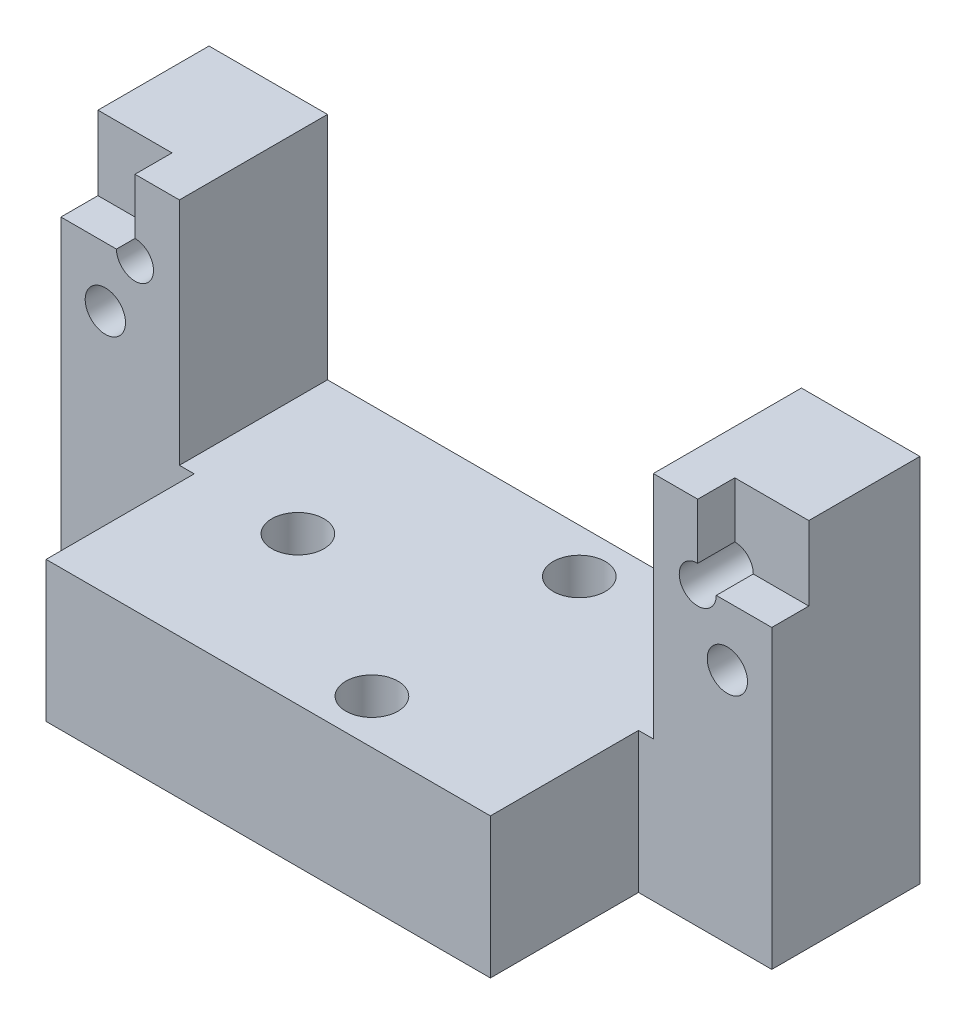
ISO-10303-21;
HEADER;
FILE_DESCRIPTION(('STEP AP214'),'2;1');
FILE_NAME('part.step','',(''),(''),'','','');
FILE_SCHEMA(('AUTOMOTIVE_DESIGN { 1 0 10303 214 1 1 1 1 }'));
ENDSEC;
DATA;
#1=APPLICATION_CONTEXT('core data for automotive mechanical design processes');
#2=APPLICATION_PROTOCOL_DEFINITION('international standard','automotive_design',2000,#1);
#3=PRODUCT_CONTEXT('',#1,'mechanical');
#4=PRODUCT('Part','Part','',(#3));
#5=PRODUCT_RELATED_PRODUCT_CATEGORY('part','',(#4));
#6=PRODUCT_DEFINITION_FORMATION('','',#4);
#7=PRODUCT_DEFINITION_CONTEXT('part definition',#1,'design');
#8=PRODUCT_DEFINITION('design','',#6,#7);
#9=PRODUCT_DEFINITION_SHAPE('','',#8);
#10=(LENGTH_UNIT() NAMED_UNIT(*) SI_UNIT(.MILLI.,.METRE.));
#11=(NAMED_UNIT(*) PLANE_ANGLE_UNIT() SI_UNIT($,.RADIAN.));
#12=(NAMED_UNIT(*) SI_UNIT($,.STERADIAN.) SOLID_ANGLE_UNIT());
#13=UNCERTAINTY_MEASURE_WITH_UNIT(LENGTH_MEASURE(1.E-05),#10,'distance_accuracy_value','');
#14=(GEOMETRIC_REPRESENTATION_CONTEXT(3) GLOBAL_UNCERTAINTY_ASSIGNED_CONTEXT((#13)) GLOBAL_UNIT_ASSIGNED_CONTEXT((#10,
#11,#12)) REPRESENTATION_CONTEXT('',''));
#15=CARTESIAN_POINT('',(0.,0.,0.));
#16=DIRECTION('',(0.,0.,1.));
#17=DIRECTION('',(1.,0.,0.));
#18=AXIS2_PLACEMENT_3D('',#15,#16,#17);
#19=CARTESIAN_POINT('',(0.,0.,0.));
#20=DIRECTION('',(0.,0.,-1.));
#21=DIRECTION('',(1.,0.,0.));
#22=AXIS2_PLACEMENT_3D('',#19,#20,#21);
#23=PLANE('',#22);
#24=CARTESIAN_POINT('',(-26.67,4.445,0.));
#25=DIRECTION('',(0.,0.,1.));
#26=DIRECTION('',(1.,0.,0.));
#27=AXIS2_PLACEMENT_3D('',#24,#25,#26);
#28=CIRCLE('',#27,1.72719999999999);
#29=CARTESIAN_POINT('',(-24.9428,4.445,0.));
#30=VERTEX_POINT('',#29);
#31=EDGE_CURVE('E485',#30,#30,#28,.T.);
#32=ORIENTED_EDGE('',*,*,#31,.F.);
#33=EDGE_LOOP('',(#32));
#34=FACE_BOUND('',#33,.T.);
#35=CARTESIAN_POINT('',(-24.13,9.525,0.));
#36=DIRECTION('',(0.,0.,-1.));
#37=DIRECTION('',(-1.,0.,0.));
#38=AXIS2_PLACEMENT_3D('',#35,#36,#37);
#39=CIRCLE('',#38,1.5875);
#40=CARTESIAN_POINT('',(-24.13,11.1125,0.));
#41=VERTEX_POINT('',#40);
#42=CARTESIAN_POINT('',(-25.7175,9.525,0.));
#43=VERTEX_POINT('',#42);
#44=EDGE_CURVE('E171',#41,#43,#39,.T.);
#45=ORIENTED_EDGE('',*,*,#44,.T.);
#46=DIRECTION('',(-1.,0.,0.));
#47=VECTOR('',#46,1.);
#48=CARTESIAN_POINT('',(-30.48,9.525,0.));
#49=LINE('',#48,#47);
#50=CARTESIAN_POINT('',(-30.48,9.525,0.));
#51=VERTEX_POINT('',#50);
#52=EDGE_CURVE('E56',#43,#51,#49,.T.);
#53=ORIENTED_EDGE('',*,*,#52,.T.);
#54=DIRECTION('',(0.,1.,0.));
#55=VECTOR('',#54,1.);
#56=CARTESIAN_POINT('',(-30.48,15.875,0.));
#57=LINE('',#56,#55);
#58=CARTESIAN_POINT('',(-30.48,-15.875,0.));
#59=VERTEX_POINT('',#58);
#60=EDGE_CURVE('E253',#59,#51,#57,.T.);
#61=ORIENTED_EDGE('',*,*,#60,.F.);
#62=DIRECTION('',(-1.,0.,0.));
#63=VECTOR('',#62,1.);
#64=CARTESIAN_POINT('',(-30.48,-15.875,0.));
#65=LINE('',#64,#63);
#66=CARTESIAN_POINT('',(-19.05,-15.875,0.));
#67=VERTEX_POINT('',#66);
#68=EDGE_CURVE('E255',#67,#59,#65,.T.);
#69=ORIENTED_EDGE('',*,*,#68,.F.);
#70=DIRECTION('',(0.,-1.,0.));
#71=VECTOR('',#70,1.);
#72=CARTESIAN_POINT('',(-19.05,15.875,0.));
#73=LINE('',#72,#71);
#74=CARTESIAN_POINT('',(-19.05,-3.8354,0.));
#75=VERTEX_POINT('',#74);
#76=EDGE_CURVE('E258',#75,#67,#73,.T.);
#77=ORIENTED_EDGE('',*,*,#76,.F.);
#78=DIRECTION('',(1.,0.,0.));
#79=VECTOR('',#78,1.);
#80=CARTESIAN_POINT('',(-20.32,-3.8354,0.));
#81=LINE('',#80,#79);
#82=CARTESIAN_POINT('',(-20.32,-3.8354,0.));
#83=VERTEX_POINT('',#82);
#84=EDGE_CURVE('E337',#83,#75,#81,.T.);
#85=ORIENTED_EDGE('',*,*,#84,.F.);
#86=DIRECTION('',(0.,-1.,0.));
#87=VECTOR('',#86,1.);
#88=CARTESIAN_POINT('',(-20.32,15.875,0.));
#89=LINE('',#88,#87);
#90=CARTESIAN_POINT('',(-20.32,15.875,0.));
#91=VERTEX_POINT('',#90);
#92=EDGE_CURVE('E266',#91,#83,#89,.T.);
#93=ORIENTED_EDGE('',*,*,#92,.F.);
#94=DIRECTION('',(1.,0.,0.));
#95=VECTOR('',#94,1.);
#96=CARTESIAN_POINT('',(-30.48,15.875,0.));
#97=LINE('',#96,#95);
#98=CARTESIAN_POINT('',(-24.13,15.875,0.));
#99=VERTEX_POINT('',#98);
#100=EDGE_CURVE('E260',#99,#91,#97,.T.);
#101=ORIENTED_EDGE('',*,*,#100,.F.);
#102=DIRECTION('',(0.,-1.,0.));
#103=VECTOR('',#102,1.);
#104=CARTESIAN_POINT('',(-24.13,15.875,0.));
#105=LINE('',#104,#103);
#106=EDGE_CURVE('E178',#99,#41,#105,.T.);
#107=ORIENTED_EDGE('',*,*,#106,.T.);
#108=EDGE_LOOP('',(#45,#53,#61,#69,#77,#85,#93,#101,#107));
#109=FACE_BOUND('',#108,.T.);
#110=ADVANCED_FACE('F34',(#34,#109),#23,.F.);
#111=CARTESIAN_POINT('',(-24.13,15.875,-3.175));
#112=DIRECTION('',(-1.,0.,0.));
#113=DIRECTION('',(0.,0.,1.));
#114=AXIS2_PLACEMENT_3D('',#111,#112,#113);
#115=PLANE('',#114);
#116=DIRECTION('',(0.,-1.,0.));
#117=VECTOR('',#116,1.);
#118=CARTESIAN_POINT('',(-24.13,15.875,-3.175));
#119=LINE('',#118,#117);
#120=CARTESIAN_POINT('',(-24.13,15.875,-3.175));
#121=VERTEX_POINT('',#120);
#122=CARTESIAN_POINT('',(-24.13,11.1125,-3.175));
#123=VERTEX_POINT('',#122);
#124=EDGE_CURVE('E473',#121,#123,#119,.T.);
#125=ORIENTED_EDGE('',*,*,#124,.T.);
#126=DIRECTION('',(0.,0.,1.));
#127=VECTOR('',#126,1.);
#128=CARTESIAN_POINT('',(-24.13,11.1125,-6.35));
#129=LINE('',#128,#127);
#130=EDGE_CURVE('E48',#123,#41,#129,.T.);
#131=ORIENTED_EDGE('',*,*,#130,.T.);
#132=ORIENTED_EDGE('',*,*,#106,.F.);
#133=DIRECTION('',(0.,0.,1.));
#134=VECTOR('',#133,1.);
#135=CARTESIAN_POINT('',(-24.13,15.875,-3.175));
#136=LINE('',#135,#134);
#137=EDGE_CURVE('E193',#121,#99,#136,.T.);
#138=ORIENTED_EDGE('',*,*,#137,.F.);
#139=EDGE_LOOP('',(#125,#131,#132,#138));
#140=FACE_BOUND('',#139,.T.);
#141=ADVANCED_FACE('F383',(#140),#115,.T.);
#142=CARTESIAN_POINT('',(-30.48,9.525,-3.175));
#143=DIRECTION('',(0.,1.,0.));
#144=DIRECTION('',(-1.,0.,0.));
#145=AXIS2_PLACEMENT_3D('',#142,#143,#144);
#146=PLANE('',#145);
#147=ORIENTED_EDGE('',*,*,#52,.F.);
#148=DIRECTION('',(0.,0.,1.));
#149=VECTOR('',#148,1.);
#150=CARTESIAN_POINT('',(-25.7175,9.525,-6.35));
#151=LINE('',#150,#149);
#152=CARTESIAN_POINT('',(-25.7175,9.525,-3.175));
#153=VERTEX_POINT('',#152);
#154=EDGE_CURVE('E169',#43,#153,#151,.F.);
#155=ORIENTED_EDGE('',*,*,#154,.T.);
#156=DIRECTION('',(-1.,0.,0.));
#157=VECTOR('',#156,1.);
#158=CARTESIAN_POINT('',(-30.48,9.525,-3.175));
#159=LINE('',#158,#157);
#160=CARTESIAN_POINT('',(-30.48,9.525,-3.175));
#161=VERTEX_POINT('',#160);
#162=EDGE_CURVE('E477',#153,#161,#159,.T.);
#163=ORIENTED_EDGE('',*,*,#162,.T.);
#164=DIRECTION('',(0.,0.,1.));
#165=VECTOR('',#164,1.);
#166=CARTESIAN_POINT('',(-30.48,9.525,-3.175));
#167=LINE('',#166,#165);
#168=EDGE_CURVE('E183',#161,#51,#167,.T.);
#169=ORIENTED_EDGE('',*,*,#168,.T.);
#170=EDGE_LOOP('',(#147,#155,#163,#169));
#171=FACE_BOUND('',#170,.T.);
#172=ADVANCED_FACE('F181',(#171),#146,.T.);
#173=CARTESIAN_POINT('',(0.,0.,-3.175));
#174=DIRECTION('',(0.,0.,-1.));
#175=DIRECTION('',(1.,0.,0.));
#176=AXIS2_PLACEMENT_3D('',#173,#174,#175);
#177=PLANE('',#176);
#178=CARTESIAN_POINT('',(-24.13,9.525,-3.175));
#179=DIRECTION('',(0.,0.,-1.));
#180=DIRECTION('',(-1.,0.,0.));
#181=AXIS2_PLACEMENT_3D('',#178,#179,#180);
#182=CIRCLE('',#181,1.5875);
#183=EDGE_CURVE('E11',#123,#153,#182,.F.);
#184=ORIENTED_EDGE('',*,*,#183,.F.);
#185=ORIENTED_EDGE('',*,*,#124,.F.);
#186=DIRECTION('',(1.,0.,0.));
#187=VECTOR('',#186,1.);
#188=CARTESIAN_POINT('',(-30.48,15.875,-3.175));
#189=LINE('',#188,#187);
#190=CARTESIAN_POINT('',(-30.48,15.875,-3.175));
#191=VERTEX_POINT('',#190);
#192=EDGE_CURVE('E190',#191,#121,#189,.T.);
#193=ORIENTED_EDGE('',*,*,#192,.F.);
#194=DIRECTION('',(0.,1.,0.));
#195=VECTOR('',#194,1.);
#196=CARTESIAN_POINT('',(-30.48,15.875,-3.175));
#197=LINE('',#196,#195);
#198=EDGE_CURVE('E186',#161,#191,#197,.T.);
#199=ORIENTED_EDGE('',*,*,#198,.F.);
#200=ORIENTED_EDGE('',*,*,#162,.F.);
#201=EDGE_LOOP('',(#184,#185,#193,#199,#200));
#202=FACE_BOUND('',#201,.T.);
#203=ADVANCED_FACE('F475',(#202),#177,.F.);
#204=CARTESIAN_POINT('',(-30.48,15.875,12.7));
#205=DIRECTION('',(0.,-1.,0.));
#206=DIRECTION('',(0.,0.,-1.));
#207=AXIS2_PLACEMENT_3D('',#204,#205,#206);
#208=PLANE('',#207);
#209=ORIENTED_EDGE('',*,*,#137,.T.);
#210=ORIENTED_EDGE('',*,*,#100,.T.);
#211=DIRECTION('',(0.,0.,1.));
#212=VECTOR('',#211,1.);
#213=CARTESIAN_POINT('',(-20.32,15.875,-12.701));
#214=LINE('',#213,#212);
#215=CARTESIAN_POINT('',(-20.32,15.875,-12.7));
#216=VERTEX_POINT('',#215);
#217=EDGE_CURVE('E294',#216,#91,#214,.T.);
#218=ORIENTED_EDGE('',*,*,#217,.F.);
#219=DIRECTION('',(-1.,0.,0.));
#220=VECTOR('',#219,1.);
#221=CARTESIAN_POINT('',(-30.48,15.875,-12.7));
#222=LINE('',#221,#220);
#223=CARTESIAN_POINT('',(-30.48,15.875,-12.7));
#224=VERTEX_POINT('',#223);
#225=EDGE_CURVE('E321',#216,#224,#222,.T.);
#226=ORIENTED_EDGE('',*,*,#225,.T.);
#227=DIRECTION('',(0.,0.,-1.));
#228=VECTOR('',#227,1.);
#229=CARTESIAN_POINT('',(-30.48,15.875,12.7));
#230=LINE('',#229,#228);
#231=EDGE_CURVE('E311',#191,#224,#230,.T.);
#232=ORIENTED_EDGE('',*,*,#231,.F.);
#233=ORIENTED_EDGE('',*,*,#192,.T.);
#234=EDGE_LOOP('',(#209,#210,#218,#226,#232,#233));
#235=FACE_BOUND('',#234,.T.);
#236=ADVANCED_FACE('F428',(#235),#208,.F.);
#237=CARTESIAN_POINT('',(-30.48,15.875,12.7));
#238=DIRECTION('',(1.,0.,0.));
#239=DIRECTION('',(0.,0.,-1.));
#240=AXIS2_PLACEMENT_3D('',#237,#238,#239);
#241=PLANE('',#240);
#242=ORIENTED_EDGE('',*,*,#168,.F.);
#243=ORIENTED_EDGE('',*,*,#198,.T.);
#244=ORIENTED_EDGE('',*,*,#231,.T.);
#245=DIRECTION('',(0.,-1.,0.));
#246=VECTOR('',#245,1.);
#247=CARTESIAN_POINT('',(-30.48,15.875,-12.7));
#248=LINE('',#247,#246);
#249=CARTESIAN_POINT('',(-30.48,-15.875,-12.7));
#250=VERTEX_POINT('',#249);
#251=EDGE_CURVE('E308',#224,#250,#248,.T.);
#252=ORIENTED_EDGE('',*,*,#251,.T.);
#253=DIRECTION('',(0.,0.,-1.));
#254=VECTOR('',#253,1.);
#255=CARTESIAN_POINT('',(-30.48,-15.875,12.7));
#256=LINE('',#255,#254);
#257=EDGE_CURVE('E329',#59,#250,#256,.T.);
#258=ORIENTED_EDGE('',*,*,#257,.F.);
#259=ORIENTED_EDGE('',*,*,#60,.T.);
#260=EDGE_LOOP('',(#242,#243,#244,#252,#258,#259));
#261=FACE_BOUND('',#260,.T.);
#262=ADVANCED_FACE('F36',(#261),#241,.F.);
#263=CARTESIAN_POINT('',(0.,0.,0.));
#264=DIRECTION('',(0.,0.,-1.));
#265=DIRECTION('',(-1.,0.,0.));
#266=AXIS2_PLACEMENT_3D('',#263,#264,#265);
#267=PLANE('',#266);
#268=DIRECTION('',(1.,0.,0.));
#269=VECTOR('',#268,1.);
#270=CARTESIAN_POINT('',(30.48,9.525,0.));
#271=LINE('',#270,#269);
#272=CARTESIAN_POINT('',(25.7175,9.525,0.));
#273=VERTEX_POINT('',#272);
#274=CARTESIAN_POINT('',(30.48,9.525,0.));
#275=VERTEX_POINT('',#274);
#276=EDGE_CURVE('E236',#273,#275,#271,.T.);
#277=ORIENTED_EDGE('',*,*,#276,.F.);
#278=CARTESIAN_POINT('',(24.13,9.525,0.));
#279=DIRECTION('',(0.,0.,1.));
#280=DIRECTION('',(1.,0.,0.));
#281=AXIS2_PLACEMENT_3D('',#278,#279,#280);
#282=CIRCLE('',#281,1.5875);
#283=CARTESIAN_POINT('',(24.13,11.1125,0.));
#284=VERTEX_POINT('',#283);
#285=EDGE_CURVE('E221',#284,#273,#282,.T.);
#286=ORIENTED_EDGE('',*,*,#285,.F.);
#287=DIRECTION('',(0.,-1.,0.));
#288=VECTOR('',#287,1.);
#289=CARTESIAN_POINT('',(24.13,15.875,0.));
#290=LINE('',#289,#288);
#291=CARTESIAN_POINT('',(24.13,15.875,0.));
#292=VERTEX_POINT('',#291);
#293=EDGE_CURVE('E232',#292,#284,#290,.T.);
#294=ORIENTED_EDGE('',*,*,#293,.F.);
#295=DIRECTION('',(-1.,0.,0.));
#296=VECTOR('',#295,1.);
#297=CARTESIAN_POINT('',(30.48,15.875,0.));
#298=LINE('',#297,#296);
#299=CARTESIAN_POINT('',(20.32,15.875,0.));
#300=VERTEX_POINT('',#299);
#301=EDGE_CURVE('E273',#292,#300,#298,.T.);
#302=ORIENTED_EDGE('',*,*,#301,.T.);
#303=DIRECTION('',(0.,1.,0.));
#304=VECTOR('',#303,1.);
#305=CARTESIAN_POINT('',(20.32,15.875,0.));
#306=LINE('',#305,#304);
#307=CARTESIAN_POINT('',(20.32,-3.8354,0.));
#308=VERTEX_POINT('',#307);
#309=EDGE_CURVE('E284',#308,#300,#306,.T.);
#310=ORIENTED_EDGE('',*,*,#309,.F.);
#311=DIRECTION('',(1.,0.,0.));
#312=VECTOR('',#311,1.);
#313=CARTESIAN_POINT('',(-20.32,-3.8354,0.));
#314=LINE('',#313,#312);
#315=CARTESIAN_POINT('',(19.05,-3.8354,0.));
#316=VERTEX_POINT('',#315);
#317=EDGE_CURVE('E331',#316,#308,#314,.T.);
#318=ORIENTED_EDGE('',*,*,#317,.F.);
#319=DIRECTION('',(0.,-1.,0.));
#320=VECTOR('',#319,1.);
#321=CARTESIAN_POINT('',(19.05,15.875,0.));
#322=LINE('',#321,#320);
#323=CARTESIAN_POINT('',(19.05,-15.875,0.));
#324=VERTEX_POINT('',#323);
#325=EDGE_CURVE('E275',#316,#324,#322,.T.);
#326=ORIENTED_EDGE('',*,*,#325,.T.);
#327=DIRECTION('',(1.,0.,0.));
#328=VECTOR('',#327,1.);
#329=CARTESIAN_POINT('',(30.48,-15.875,0.));
#330=LINE('',#329,#328);
#331=CARTESIAN_POINT('',(30.48,-15.875,0.));
#332=VERTEX_POINT('',#331);
#333=EDGE_CURVE('E277',#324,#332,#330,.T.);
#334=ORIENTED_EDGE('',*,*,#333,.T.);
#335=DIRECTION('',(0.,1.,0.));
#336=VECTOR('',#335,1.);
#337=CARTESIAN_POINT('',(30.48,15.875,0.));
#338=LINE('',#337,#336);
#339=EDGE_CURVE('E270',#332,#275,#338,.T.);
#340=ORIENTED_EDGE('',*,*,#339,.T.);
#341=EDGE_LOOP('',(#277,#286,#294,#302,#310,#318,#326,#334,#340));
#342=FACE_BOUND('',#341,.T.);
#343=CARTESIAN_POINT('',(26.67,4.445,0.));
#344=DIRECTION('',(0.,0.,1.));
#345=DIRECTION('',(1.,0.,0.));
#346=AXIS2_PLACEMENT_3D('',#343,#344,#345);
#347=CIRCLE('',#346,1.72719999999999);
#348=CARTESIAN_POINT('',(28.3972,4.445,0.));
#349=VERTEX_POINT('',#348);
#350=EDGE_CURVE('E215',#349,#349,#347,.T.);
#351=ORIENTED_EDGE('',*,*,#350,.F.);
#352=EDGE_LOOP('',(#351));
#353=FACE_BOUND('',#352,.T.);
#354=ADVANCED_FACE('F366',(#342,#353),#267,.F.);
#355=CARTESIAN_POINT('',(-30.48,-15.875,12.7));
#356=DIRECTION('',(0.,1.,0.));
#357=DIRECTION('',(0.,0.,1.));
#358=AXIS2_PLACEMENT_3D('',#355,#356,#357);
#359=PLANE('',#358);
#360=CARTESIAN_POINT('',(-10.16,-15.875,0.));
#361=DIRECTION('',(0.,1.,0.));
#362=DIRECTION('',(0.,0.,1.));
#363=AXIS2_PLACEMENT_3D('',#360,#361,#362);
#364=CIRCLE('',#363,2.2352);
#365=CARTESIAN_POINT('',(-10.16,-15.875,2.2352));
#366=VERTEX_POINT('',#365);
#367=EDGE_CURVE('E200',#366,#366,#364,.F.);
#368=ORIENTED_EDGE('',*,*,#367,.F.);
#369=EDGE_LOOP('',(#368));
#370=FACE_BOUND('',#369,.T.);
#371=CARTESIAN_POINT('',(5.08,-15.875,8.89));
#372=DIRECTION('',(0.,1.,0.));
#373=DIRECTION('',(0.,0.,1.));
#374=AXIS2_PLACEMENT_3D('',#371,#372,#373);
#375=CIRCLE('',#374,2.2352);
#376=CARTESIAN_POINT('',(5.08,-15.875,11.1252));
#377=VERTEX_POINT('',#376);
#378=EDGE_CURVE('E206',#377,#377,#375,.F.);
#379=ORIENTED_EDGE('',*,*,#378,.F.);
#380=EDGE_LOOP('',(#379));
#381=FACE_BOUND('',#380,.T.);
#382=CARTESIAN_POINT('',(5.08,-15.875,-8.89));
#383=DIRECTION('',(0.,1.,0.));
#384=DIRECTION('',(0.,0.,1.));
#385=AXIS2_PLACEMENT_3D('',#382,#383,#384);
#386=CIRCLE('',#385,2.2352);
#387=CARTESIAN_POINT('',(5.08,-15.875,-6.6548));
#388=VERTEX_POINT('',#387);
#389=EDGE_CURVE('E212',#388,#388,#386,.F.);
#390=ORIENTED_EDGE('',*,*,#389,.F.);
#391=EDGE_LOOP('',(#390));
#392=FACE_BOUND('',#391,.T.);
#393=DIRECTION('',(0.,0.,1.));
#394=VECTOR('',#393,1.);
#395=CARTESIAN_POINT('',(-19.05,-15.875,0.));
#396=LINE('',#395,#394);
#397=CARTESIAN_POINT('',(-19.05,-15.875,12.7));
#398=VERTEX_POINT('',#397);
#399=EDGE_CURVE('E262',#67,#398,#396,.T.);
#400=ORIENTED_EDGE('',*,*,#399,.F.);
#401=ORIENTED_EDGE('',*,*,#68,.T.);
#402=ORIENTED_EDGE('',*,*,#257,.T.);
#403=DIRECTION('',(1.,0.,0.));
#404=VECTOR('',#403,1.);
#405=CARTESIAN_POINT('',(-30.48,-15.875,-12.7));
#406=LINE('',#405,#404);
#407=CARTESIAN_POINT('',(30.48,-15.875,-12.7));
#408=VERTEX_POINT('',#407);
#409=EDGE_CURVE('E315',#250,#408,#406,.T.);
#410=ORIENTED_EDGE('',*,*,#409,.T.);
#411=DIRECTION('',(0.,0.,-1.));
#412=VECTOR('',#411,1.);
#413=CARTESIAN_POINT('',(30.48,-15.875,12.7));
#414=LINE('',#413,#412);
#415=EDGE_CURVE('E327',#332,#408,#414,.T.);
#416=ORIENTED_EDGE('',*,*,#415,.F.);
#417=ORIENTED_EDGE('',*,*,#333,.F.);
#418=DIRECTION('',(0.,0.,1.));
#419=VECTOR('',#418,1.);
#420=CARTESIAN_POINT('',(19.05,-15.875,0.));
#421=LINE('',#420,#419);
#422=CARTESIAN_POINT('',(19.05,-15.875,12.7));
#423=VERTEX_POINT('',#422);
#424=EDGE_CURVE('E279',#324,#423,#421,.T.);
#425=ORIENTED_EDGE('',*,*,#424,.T.);
#426=DIRECTION('',(1.,0.,0.));
#427=VECTOR('',#426,1.);
#428=CARTESIAN_POINT('',(-30.48,-15.875,12.7));
#429=LINE('',#428,#427);
#430=EDGE_CURVE('E309',#398,#423,#429,.T.);
#431=ORIENTED_EDGE('',*,*,#430,.F.);
#432=EDGE_LOOP('',(#400,#401,#402,#410,#416,#417,#425,#431));
#433=FACE_BOUND('',#432,.T.);
#434=ADVANCED_FACE('F402',(#370,#381,#392,#433),#359,.F.);
#435=CARTESIAN_POINT('',(0.,0.,12.7));
#436=DIRECTION('',(0.,0.,1.));
#437=DIRECTION('',(1.,0.,0.));
#438=AXIS2_PLACEMENT_3D('',#435,#436,#437);
#439=PLANE('',#438);
#440=DIRECTION('',(1.,0.,0.));
#441=VECTOR('',#440,1.);
#442=CARTESIAN_POINT('',(-20.32,-3.8354,12.7));
#443=LINE('',#442,#441);
#444=CARTESIAN_POINT('',(-19.05,-3.8354,12.7));
#445=VERTEX_POINT('',#444);
#446=CARTESIAN_POINT('',(19.05,-3.8354,12.7));
#447=VERTEX_POINT('',#446);
#448=EDGE_CURVE('E291',#445,#447,#443,.T.);
#449=ORIENTED_EDGE('',*,*,#448,.F.);
#450=DIRECTION('',(0.,-1.,0.));
#451=VECTOR('',#450,1.);
#452=CARTESIAN_POINT('',(-19.05,15.875,12.7));
#453=LINE('',#452,#451);
#454=EDGE_CURVE('E251',#445,#398,#453,.T.);
#455=ORIENTED_EDGE('',*,*,#454,.T.);
#456=ORIENTED_EDGE('',*,*,#430,.T.);
#457=DIRECTION('',(0.,-1.,0.));
#458=VECTOR('',#457,1.);
#459=CARTESIAN_POINT('',(19.05,15.875,12.7));
#460=LINE('',#459,#458);
#461=EDGE_CURVE('E269',#447,#423,#460,.T.);
#462=ORIENTED_EDGE('',*,*,#461,.F.);
#463=EDGE_LOOP('',(#449,#455,#456,#462));
#464=FACE_BOUND('',#463,.T.);
#465=ADVANCED_FACE('F414',(#464),#439,.T.);
#466=CARTESIAN_POINT('',(-20.32,-3.8354,-12.701));
#467=DIRECTION('',(0.,-1.,0.));
#468=DIRECTION('',(0.,0.,-1.));
#469=AXIS2_PLACEMENT_3D('',#466,#467,#468);
#470=PLANE('',#469);
#471=CARTESIAN_POINT('',(-10.16,-3.8354,0.));
#472=DIRECTION('',(0.,1.,0.));
#473=DIRECTION('',(0.,0.,1.));
#474=AXIS2_PLACEMENT_3D('',#471,#472,#473);
#475=CIRCLE('',#474,2.2352);
#476=CARTESIAN_POINT('',(-10.16,-3.8354,2.2352));
#477=VERTEX_POINT('',#476);
#478=EDGE_CURVE('E196',#477,#477,#475,.T.);
#479=ORIENTED_EDGE('',*,*,#478,.F.);
#480=EDGE_LOOP('',(#479));
#481=FACE_BOUND('',#480,.T.);
#482=CARTESIAN_POINT('',(5.08,-3.8354,8.89));
#483=DIRECTION('',(0.,1.,0.));
#484=DIRECTION('',(0.,0.,1.));
#485=AXIS2_PLACEMENT_3D('',#482,#483,#484);
#486=CIRCLE('',#485,2.2352);
#487=CARTESIAN_POINT('',(5.08,-3.8354,11.1252));
#488=VERTEX_POINT('',#487);
#489=EDGE_CURVE('E203',#488,#488,#486,.T.);
#490=ORIENTED_EDGE('',*,*,#489,.F.);
#491=EDGE_LOOP('',(#490));
#492=FACE_BOUND('',#491,.T.);
#493=CARTESIAN_POINT('',(5.08,-3.8354,-8.89));
#494=DIRECTION('',(0.,1.,0.));
#495=DIRECTION('',(0.,0.,1.));
#496=AXIS2_PLACEMENT_3D('',#493,#494,#495);
#497=CIRCLE('',#496,2.2352);
#498=CARTESIAN_POINT('',(5.08,-3.8354,-6.6548));
#499=VERTEX_POINT('',#498);
#500=EDGE_CURVE('E209',#499,#499,#497,.T.);
#501=ORIENTED_EDGE('',*,*,#500,.F.);
#502=EDGE_LOOP('',(#501));
#503=FACE_BOUND('',#502,.T.);
#504=DIRECTION('',(0.,0.,-1.));
#505=VECTOR('',#504,1.);
#506=CARTESIAN_POINT('',(-19.05,-3.8354,-12.701));
#507=LINE('',#506,#505);
#508=EDGE_CURVE('E340',#445,#75,#507,.T.);
#509=ORIENTED_EDGE('',*,*,#508,.F.);
#510=ORIENTED_EDGE('',*,*,#448,.T.);
#511=DIRECTION('',(0.,0.,-1.));
#512=VECTOR('',#511,1.);
#513=CARTESIAN_POINT('',(19.05,-3.8354,-12.701));
#514=LINE('',#513,#512);
#515=EDGE_CURVE('E334',#447,#316,#514,.T.);
#516=ORIENTED_EDGE('',*,*,#515,.T.);
#517=ORIENTED_EDGE('',*,*,#317,.T.);
#518=DIRECTION('',(0.,0.,1.));
#519=VECTOR('',#518,1.);
#520=CARTESIAN_POINT('',(20.32,-3.8354,-12.701));
#521=LINE('',#520,#519);
#522=CARTESIAN_POINT('',(20.32,-3.8354,-12.7));
#523=VERTEX_POINT('',#522);
#524=EDGE_CURVE('E301',#523,#308,#521,.T.);
#525=ORIENTED_EDGE('',*,*,#524,.F.);
#526=DIRECTION('',(-1.,0.,0.));
#527=VECTOR('',#526,1.);
#528=CARTESIAN_POINT('',(-20.32,-3.8354,-12.7));
#529=LINE('',#528,#527);
#530=CARTESIAN_POINT('',(-20.32,-3.8354,-12.7));
#531=VERTEX_POINT('',#530);
#532=EDGE_CURVE('E297',#523,#531,#529,.T.);
#533=ORIENTED_EDGE('',*,*,#532,.T.);
#534=DIRECTION('',(0.,0.,1.));
#535=VECTOR('',#534,1.);
#536=CARTESIAN_POINT('',(-20.32,-3.8354,-12.701));
#537=LINE('',#536,#535);
#538=EDGE_CURVE('E293',#531,#83,#537,.T.);
#539=ORIENTED_EDGE('',*,*,#538,.T.);
#540=ORIENTED_EDGE('',*,*,#84,.T.);
#541=EDGE_LOOP('',(#509,#510,#516,#517,#525,#533,#539,#540));
#542=FACE_BOUND('',#541,.T.);
#543=ADVANCED_FACE('F411',(#481,#492,#503,#542),#470,.F.);
#544=CARTESIAN_POINT('',(30.48,15.875,12.7));
#545=DIRECTION('',(-1.,0.,0.));
#546=DIRECTION('',(0.,-1.,0.));
#547=AXIS2_PLACEMENT_3D('',#544,#545,#546);
#548=PLANE('',#547);
#549=DIRECTION('',(0.,1.,0.));
#550=VECTOR('',#549,1.);
#551=CARTESIAN_POINT('',(30.48,15.875,-3.175));
#552=LINE('',#551,#550);
#553=CARTESIAN_POINT('',(30.48,9.525,-3.175));
#554=VERTEX_POINT('',#553);
#555=CARTESIAN_POINT('',(30.48,15.875,-3.175));
#556=VERTEX_POINT('',#555);
#557=EDGE_CURVE('E233',#554,#556,#552,.T.);
#558=ORIENTED_EDGE('',*,*,#557,.F.);
#559=DIRECTION('',(0.,0.,1.));
#560=VECTOR('',#559,1.);
#561=CARTESIAN_POINT('',(30.48,9.525,-3.175));
#562=LINE('',#561,#560);
#563=EDGE_CURVE('E248',#554,#275,#562,.T.);
#564=ORIENTED_EDGE('',*,*,#563,.T.);
#565=ORIENTED_EDGE('',*,*,#339,.F.);
#566=ORIENTED_EDGE('',*,*,#415,.T.);
#567=DIRECTION('',(0.,1.,0.));
#568=VECTOR('',#567,1.);
#569=CARTESIAN_POINT('',(30.48,15.875,-12.7));
#570=LINE('',#569,#568);
#571=CARTESIAN_POINT('',(30.48,15.875,-12.7));
#572=VERTEX_POINT('',#571);
#573=EDGE_CURVE('E318',#408,#572,#570,.T.);
#574=ORIENTED_EDGE('',*,*,#573,.T.);
#575=DIRECTION('',(0.,0.,-1.));
#576=VECTOR('',#575,1.);
#577=CARTESIAN_POINT('',(30.48,15.875,12.7));
#578=LINE('',#577,#576);
#579=EDGE_CURVE('E325',#556,#572,#578,.T.);
#580=ORIENTED_EDGE('',*,*,#579,.F.);
#581=EDGE_LOOP('',(#558,#564,#565,#566,#574,#580));
#582=FACE_BOUND('',#581,.T.);
#583=ADVANCED_FACE('F355',(#582),#548,.F.);
#584=ORIENTED_EDGE('',*,*,#301,.F.);
#585=DIRECTION('',(0.,0.,1.));
#586=VECTOR('',#585,1.);
#587=CARTESIAN_POINT('',(24.13,15.875,-3.175));
#588=LINE('',#587,#586);
#589=CARTESIAN_POINT('',(24.13,15.875,-3.175));
#590=VERTEX_POINT('',#589);
#591=EDGE_CURVE('E244',#590,#292,#588,.T.);
#592=ORIENTED_EDGE('',*,*,#591,.F.);
#593=DIRECTION('',(-1.,0.,0.));
#594=VECTOR('',#593,1.);
#595=CARTESIAN_POINT('',(30.48,15.875,-3.175));
#596=LINE('',#595,#594);
#597=EDGE_CURVE('E235',#556,#590,#596,.T.);
#598=ORIENTED_EDGE('',*,*,#597,.F.);
#599=ORIENTED_EDGE('',*,*,#579,.T.);
#600=CARTESIAN_POINT('',(20.32,15.875,-12.7));
#601=VERTEX_POINT('',#600);
#602=EDGE_CURVE('E312',#572,#601,#222,.T.);
#603=ORIENTED_EDGE('',*,*,#602,.T.);
#604=DIRECTION('',(0.,0.,1.));
#605=VECTOR('',#604,1.);
#606=CARTESIAN_POINT('',(20.32,15.875,-12.701));
#607=LINE('',#606,#605);
#608=EDGE_CURVE('E298',#601,#300,#607,.T.);
#609=ORIENTED_EDGE('',*,*,#608,.T.);
#610=EDGE_LOOP('',(#584,#592,#598,#599,#603,#609));
#611=FACE_BOUND('',#610,.T.);
#612=ADVANCED_FACE('F360',(#611),#208,.F.);
#613=CARTESIAN_POINT('',(0.,0.,-12.7));
#614=DIRECTION('',(0.,0.,1.));
#615=DIRECTION('',(1.,0.,0.));
#616=AXIS2_PLACEMENT_3D('',#613,#614,#615);
#617=PLANE('',#616);
#618=CARTESIAN_POINT('',(-26.67,4.445,-12.7));
#619=DIRECTION('',(0.,0.,1.));
#620=DIRECTION('',(1.,0.,0.));
#621=AXIS2_PLACEMENT_3D('',#618,#619,#620);
#622=CIRCLE('',#621,1.72719999999999);
#623=CARTESIAN_POINT('',(-24.9428,4.445,-12.7));
#624=VERTEX_POINT('',#623);
#625=EDGE_CURVE('E179',#624,#624,#622,.T.);
#626=ORIENTED_EDGE('',*,*,#625,.T.);
#627=EDGE_LOOP('',(#626));
#628=FACE_BOUND('',#627,.T.);
#629=CARTESIAN_POINT('',(26.67,4.445,-12.7));
#630=DIRECTION('',(0.,0.,1.));
#631=DIRECTION('',(1.,0.,0.));
#632=AXIS2_PLACEMENT_3D('',#629,#630,#631);
#633=CIRCLE('',#632,1.72719999999999);
#634=CARTESIAN_POINT('',(28.3972,4.445,-12.7));
#635=VERTEX_POINT('',#634);
#636=EDGE_CURVE('E218',#635,#635,#633,.T.);
#637=ORIENTED_EDGE('',*,*,#636,.T.);
#638=EDGE_LOOP('',(#637));
#639=FACE_BOUND('',#638,.T.);
#640=ORIENTED_EDGE('',*,*,#225,.F.);
#641=DIRECTION('',(0.,1.,0.));
#642=VECTOR('',#641,1.);
#643=CARTESIAN_POINT('',(-20.32,15.875,-12.7));
#644=LINE('',#643,#642);
#645=EDGE_CURVE('E289',#531,#216,#644,.T.);
#646=ORIENTED_EDGE('',*,*,#645,.F.);
#647=ORIENTED_EDGE('',*,*,#532,.F.);
#648=DIRECTION('',(0.,-1.,0.));
#649=VECTOR('',#648,1.);
#650=CARTESIAN_POINT('',(20.32,15.875,-12.7));
#651=LINE('',#650,#649);
#652=EDGE_CURVE('E287',#601,#523,#651,.T.);
#653=ORIENTED_EDGE('',*,*,#652,.F.);
#654=ORIENTED_EDGE('',*,*,#602,.F.);
#655=ORIENTED_EDGE('',*,*,#573,.F.);
#656=ORIENTED_EDGE('',*,*,#409,.F.);
#657=ORIENTED_EDGE('',*,*,#251,.F.);
#658=EDGE_LOOP('',(#640,#646,#647,#653,#654,#655,#656,#657));
#659=FACE_BOUND('',#658,.T.);
#660=ADVANCED_FACE('F418',(#628,#639,#659),#617,.F.);
#661=CARTESIAN_POINT('',(-20.32,15.875,-12.701));
#662=DIRECTION('',(-1.,0.,0.));
#663=DIRECTION('',(0.,0.,1.));
#664=AXIS2_PLACEMENT_3D('',#661,#662,#663);
#665=PLANE('',#664);
#666=ORIENTED_EDGE('',*,*,#217,.T.);
#667=ORIENTED_EDGE('',*,*,#92,.T.);
#668=ORIENTED_EDGE('',*,*,#538,.F.);
#669=ORIENTED_EDGE('',*,*,#645,.T.);
#670=EDGE_LOOP('',(#666,#667,#668,#669));
#671=FACE_BOUND('',#670,.T.);
#672=ADVANCED_FACE('F409',(#671),#665,.F.);
#673=CARTESIAN_POINT('',(20.32,15.875,-12.701));
#674=DIRECTION('',(1.,0.,0.));
#675=DIRECTION('',(0.,0.,-1.));
#676=AXIS2_PLACEMENT_3D('',#673,#674,#675);
#677=PLANE('',#676);
#678=ORIENTED_EDGE('',*,*,#524,.T.);
#679=ORIENTED_EDGE('',*,*,#309,.T.);
#680=ORIENTED_EDGE('',*,*,#608,.F.);
#681=ORIENTED_EDGE('',*,*,#652,.T.);
#682=EDGE_LOOP('',(#678,#679,#680,#681));
#683=FACE_BOUND('',#682,.T.);
#684=ADVANCED_FACE('F405',(#683),#677,.F.);
#685=CARTESIAN_POINT('',(19.05,15.875,0.));
#686=DIRECTION('',(-1.,0.,0.));
#687=DIRECTION('',(0.,-1.,0.));
#688=AXIS2_PLACEMENT_3D('',#685,#686,#687);
#689=PLANE('',#688);
#690=ORIENTED_EDGE('',*,*,#461,.T.);
#691=ORIENTED_EDGE('',*,*,#424,.F.);
#692=ORIENTED_EDGE('',*,*,#325,.F.);
#693=ORIENTED_EDGE('',*,*,#515,.F.);
#694=EDGE_LOOP('',(#690,#691,#692,#693));
#695=FACE_BOUND('',#694,.T.);
#696=ADVANCED_FACE('F398',(#695),#689,.F.);
#697=CARTESIAN_POINT('',(-19.05,15.875,0.));
#698=DIRECTION('',(-1.,0.,0.));
#699=DIRECTION('',(0.,-1.,0.));
#700=AXIS2_PLACEMENT_3D('',#697,#698,#699);
#701=PLANE('',#700);
#702=ORIENTED_EDGE('',*,*,#508,.T.);
#703=ORIENTED_EDGE('',*,*,#76,.T.);
#704=ORIENTED_EDGE('',*,*,#399,.T.);
#705=ORIENTED_EDGE('',*,*,#454,.F.);
#706=EDGE_LOOP('',(#702,#703,#704,#705));
#707=FACE_BOUND('',#706,.T.);
#708=ADVANCED_FACE('F395',(#707),#701,.T.);
#709=CARTESIAN_POINT('',(30.48,9.525,-3.175));
#710=DIRECTION('',(0.,-1.,0.));
#711=DIRECTION('',(1.,0.,0.));
#712=AXIS2_PLACEMENT_3D('',#709,#710,#711);
#713=PLANE('',#712);
#714=DIRECTION('',(1.,0.,0.));
#715=VECTOR('',#714,1.);
#716=CARTESIAN_POINT('',(30.48,9.525,-3.175));
#717=LINE('',#716,#715);
#718=CARTESIAN_POINT('',(25.7175,9.525,-3.175));
#719=VERTEX_POINT('',#718);
#720=EDGE_CURVE('E242',#719,#554,#717,.T.);
#721=ORIENTED_EDGE('',*,*,#720,.F.);
#722=DIRECTION('',(0.,0.,1.));
#723=VECTOR('',#722,1.);
#724=CARTESIAN_POINT('',(25.7175,9.525,-6.35));
#725=LINE('',#724,#723);
#726=EDGE_CURVE('E229',#719,#273,#725,.T.);
#727=ORIENTED_EDGE('',*,*,#726,.T.);
#728=ORIENTED_EDGE('',*,*,#276,.T.);
#729=ORIENTED_EDGE('',*,*,#563,.F.);
#730=EDGE_LOOP('',(#721,#727,#728,#729));
#731=FACE_BOUND('',#730,.T.);
#732=ADVANCED_FACE('F349',(#731),#713,.F.);
#733=CARTESIAN_POINT('',(24.13,15.875,-3.175));
#734=DIRECTION('',(-1.,0.,0.));
#735=DIRECTION('',(0.,0.,1.));
#736=AXIS2_PLACEMENT_3D('',#733,#734,#735);
#737=PLANE('',#736);
#738=ORIENTED_EDGE('',*,*,#293,.T.);
#739=DIRECTION('',(0.,0.,1.));
#740=VECTOR('',#739,1.);
#741=CARTESIAN_POINT('',(24.13,11.1125,-6.35));
#742=LINE('',#741,#740);
#743=CARTESIAN_POINT('',(24.13,11.1125,-3.175));
#744=VERTEX_POINT('',#743);
#745=EDGE_CURVE('E225',#284,#744,#742,.F.);
#746=ORIENTED_EDGE('',*,*,#745,.T.);
#747=DIRECTION('',(0.,-1.,0.));
#748=VECTOR('',#747,1.);
#749=CARTESIAN_POINT('',(24.13,15.875,-3.175));
#750=LINE('',#749,#748);
#751=EDGE_CURVE('E239',#590,#744,#750,.T.);
#752=ORIENTED_EDGE('',*,*,#751,.F.);
#753=ORIENTED_EDGE('',*,*,#591,.T.);
#754=EDGE_LOOP('',(#738,#746,#752,#753));
#755=FACE_BOUND('',#754,.T.);
#756=ADVANCED_FACE('F363',(#755),#737,.F.);
#757=CARTESIAN_POINT('',(0.,0.,-3.175));
#758=DIRECTION('',(0.,0.,-1.));
#759=DIRECTION('',(-1.,0.,0.));
#760=AXIS2_PLACEMENT_3D('',#757,#758,#759);
#761=PLANE('',#760);
#762=ORIENTED_EDGE('',*,*,#751,.T.);
#763=CARTESIAN_POINT('',(24.13,9.525,-3.175));
#764=DIRECTION('',(0.,0.,-1.));
#765=DIRECTION('',(-1.,0.,0.));
#766=AXIS2_PLACEMENT_3D('',#763,#764,#765);
#767=CIRCLE('',#766,1.5875);
#768=EDGE_CURVE('E42',#744,#719,#767,.T.);
#769=ORIENTED_EDGE('',*,*,#768,.T.);
#770=ORIENTED_EDGE('',*,*,#720,.T.);
#771=ORIENTED_EDGE('',*,*,#557,.T.);
#772=ORIENTED_EDGE('',*,*,#597,.T.);
#773=EDGE_LOOP('',(#762,#769,#770,#771,#772));
#774=FACE_BOUND('',#773,.T.);
#775=ADVANCED_FACE('F345',(#774),#761,.F.);
#776=CARTESIAN_POINT('',(24.13,9.525,-6.35));
#777=DIRECTION('',(0.,0.,1.));
#778=DIRECTION('',(1.,0.,0.));
#779=AXIS2_PLACEMENT_3D('',#776,#777,#778);
#780=CYLINDRICAL_SURFACE('',#779,1.5875);
#781=CARTESIAN_POINT('',(24.13,9.525,-6.35));
#782=DIRECTION('',(0.,0.,1.));
#783=DIRECTION('',(1.,0.,0.));
#784=AXIS2_PLACEMENT_3D('',#781,#782,#783);
#785=CIRCLE('',#784,1.5875);
#786=CARTESIAN_POINT('',(25.7175,9.525,-6.35));
#787=VERTEX_POINT('',#786);
#788=EDGE_CURVE('E222',#787,#787,#785,.T.);
#789=ORIENTED_EDGE('',*,*,#788,.F.);
#790=EDGE_LOOP('',(#789));
#791=FACE_BOUND('',#790,.T.);
#792=ORIENTED_EDGE('',*,*,#768,.F.);
#793=ORIENTED_EDGE('',*,*,#745,.F.);
#794=ORIENTED_EDGE('',*,*,#285,.T.);
#795=ORIENTED_EDGE('',*,*,#726,.F.);
#796=EDGE_LOOP('',(#792,#793,#794,#795));
#797=FACE_BOUND('',#796,.T.);
#798=ADVANCED_FACE('F368',(#791,#797),#780,.F.);
#799=CARTESIAN_POINT('',(24.13,9.525,-6.35));
#800=DIRECTION('',(0.,0.,1.));
#801=DIRECTION('',(1.,0.,0.));
#802=AXIS2_PLACEMENT_3D('',#799,#800,#801);
#803=PLANE('',#802);
#804=ORIENTED_EDGE('',*,*,#788,.T.);
#805=EDGE_LOOP('',(#804));
#806=FACE_BOUND('',#805,.T.);
#807=ADVANCED_FACE('F370',(#806),#803,.T.);
#808=CARTESIAN_POINT('',(26.67,4.445,0.));
#809=DIRECTION('',(0.,0.,1.));
#810=DIRECTION('',(1.,0.,0.));
#811=AXIS2_PLACEMENT_3D('',#808,#809,#810);
#812=CYLINDRICAL_SURFACE('',#811,1.72719999999999);
#813=ORIENTED_EDGE('',*,*,#636,.F.);
#814=EDGE_LOOP('',(#813));
#815=FACE_BOUND('',#814,.T.);
#816=ORIENTED_EDGE('',*,*,#350,.T.);
#817=EDGE_LOOP('',(#816));
#818=FACE_BOUND('',#817,.T.);
#819=ADVANCED_FACE('F377',(#815,#818),#812,.F.);
#820=CARTESIAN_POINT('',(5.08,-15.876,-8.89));
#821=DIRECTION('',(0.,1.,0.));
#822=DIRECTION('',(0.,0.,1.));
#823=AXIS2_PLACEMENT_3D('',#820,#821,#822);
#824=CYLINDRICAL_SURFACE('',#823,2.2352);
#825=ORIENTED_EDGE('',*,*,#500,.T.);
#826=EDGE_LOOP('',(#825));
#827=FACE_BOUND('',#826,.T.);
#828=ORIENTED_EDGE('',*,*,#389,.T.);
#829=EDGE_LOOP('',(#828));
#830=FACE_BOUND('',#829,.T.);
#831=ADVANCED_FACE('F514',(#827,#830),#824,.F.);
#832=CARTESIAN_POINT('',(5.08,-15.876,8.89));
#833=DIRECTION('',(0.,1.,0.));
#834=DIRECTION('',(0.,0.,1.));
#835=AXIS2_PLACEMENT_3D('',#832,#833,#834);
#836=CYLINDRICAL_SURFACE('',#835,2.2352);
#837=ORIENTED_EDGE('',*,*,#489,.T.);
#838=EDGE_LOOP('',(#837));
#839=FACE_BOUND('',#838,.T.);
#840=ORIENTED_EDGE('',*,*,#378,.T.);
#841=EDGE_LOOP('',(#840));
#842=FACE_BOUND('',#841,.T.);
#843=ADVANCED_FACE('F510',(#839,#842),#836,.F.);
#844=CARTESIAN_POINT('',(-10.16,-15.876,0.));
#845=DIRECTION('',(0.,1.,0.));
#846=DIRECTION('',(0.,0.,1.));
#847=AXIS2_PLACEMENT_3D('',#844,#845,#846);
#848=CYLINDRICAL_SURFACE('',#847,2.2352);
#849=ORIENTED_EDGE('',*,*,#478,.T.);
#850=EDGE_LOOP('',(#849));
#851=FACE_BOUND('',#850,.T.);
#852=ORIENTED_EDGE('',*,*,#367,.T.);
#853=EDGE_LOOP('',(#852));
#854=FACE_BOUND('',#853,.T.);
#855=ADVANCED_FACE('F502',(#851,#854),#848,.F.);
#856=CARTESIAN_POINT('',(-24.13,9.525,-6.35));
#857=DIRECTION('',(0.,0.,1.));
#858=DIRECTION('',(1.,0.,0.));
#859=AXIS2_PLACEMENT_3D('',#856,#857,#858);
#860=CYLINDRICAL_SURFACE('',#859,1.5875);
#861=CARTESIAN_POINT('',(-24.13,9.525,-6.35));
#862=DIRECTION('',(0.,0.,-1.));
#863=DIRECTION('',(-1.,0.,0.));
#864=AXIS2_PLACEMENT_3D('',#861,#862,#863);
#865=CIRCLE('',#864,1.5875);
#866=CARTESIAN_POINT('',(-25.7175,9.525,-6.35));
#867=VERTEX_POINT('',#866);
#868=EDGE_CURVE('E174',#867,#867,#865,.T.);
#869=ORIENTED_EDGE('',*,*,#868,.T.);
#870=EDGE_LOOP('',(#869));
#871=FACE_BOUND('',#870,.T.);
#872=ORIENTED_EDGE('',*,*,#183,.T.);
#873=ORIENTED_EDGE('',*,*,#154,.F.);
#874=ORIENTED_EDGE('',*,*,#44,.F.);
#875=ORIENTED_EDGE('',*,*,#130,.F.);
#876=EDGE_LOOP('',(#872,#873,#874,#875));
#877=FACE_BOUND('',#876,.T.);
#878=ADVANCED_FACE('F170',(#871,#877),#860,.F.);
#879=CARTESIAN_POINT('',(-24.13,9.525,-6.35));
#880=DIRECTION('',(0.,0.,1.));
#881=DIRECTION('',(-1.,0.,0.));
#882=AXIS2_PLACEMENT_3D('',#879,#880,#881);
#883=PLANE('',#882);
#884=ORIENTED_EDGE('',*,*,#868,.F.);
#885=EDGE_LOOP('',(#884));
#886=FACE_BOUND('',#885,.T.);
#887=ADVANCED_FACE('F490',(#886),#883,.T.);
#888=CARTESIAN_POINT('',(-26.67,4.445,0.));
#889=DIRECTION('',(0.,0.,1.));
#890=DIRECTION('',(1.,0.,0.));
#891=AXIS2_PLACEMENT_3D('',#888,#889,#890);
#892=CYLINDRICAL_SURFACE('',#891,1.72719999999999);
#893=ORIENTED_EDGE('',*,*,#625,.F.);
#894=EDGE_LOOP('',(#893));
#895=FACE_BOUND('',#894,.T.);
#896=ORIENTED_EDGE('',*,*,#31,.T.);
#897=EDGE_LOOP('',(#896));
#898=FACE_BOUND('',#897,.T.);
#899=ADVANCED_FACE('F488',(#895,#898),#892,.F.);
#900=CLOSED_SHELL('',(#110,#141,#172,#203,#236,#262,#354,#434,#465,#543,#583,#612,#660,#672,
#684,#696,#708,#732,#756,#775,#798,#807,#819,#831,#843,#855,#878,#887,#899));
#901=MANIFOLD_SOLID_BREP('B2',#900);
#902=ADVANCED_BREP_SHAPE_REPRESENTATION('',(#18,#901),#14);
#903=SHAPE_DEFINITION_REPRESENTATION(#9,#902);
ENDSEC;
END-ISO-10303-21;
